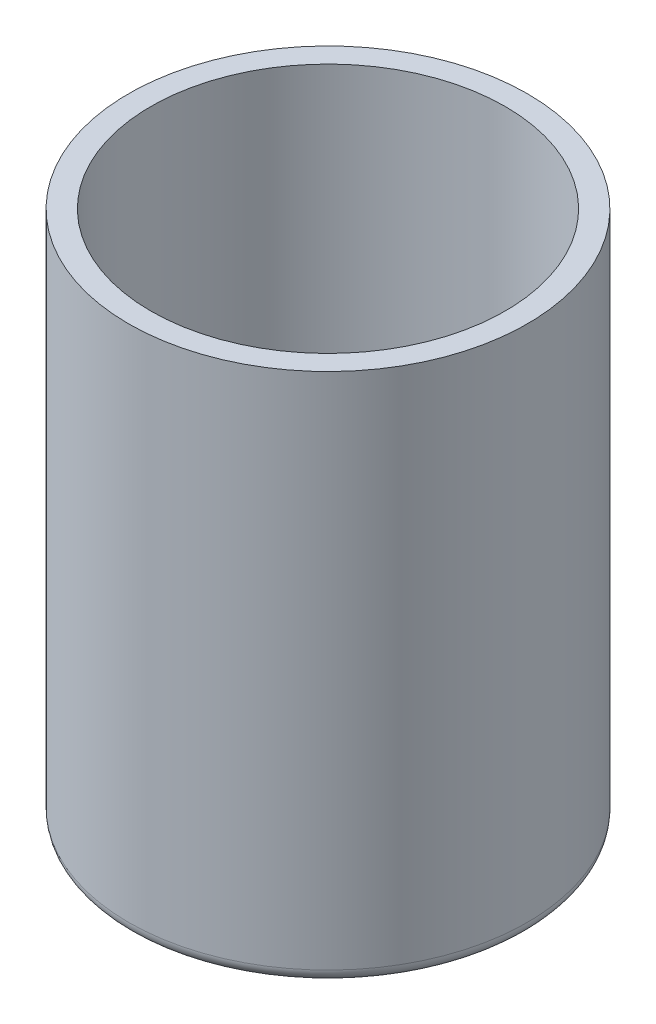
ISO-10303-21;
HEADER;
FILE_DESCRIPTION(('STEP AP214'),'2;1');
FILE_NAME('part.step','',(''),(''),'','','');
FILE_SCHEMA(('AUTOMOTIVE_DESIGN { 1 0 10303 214 1 1 1 1 }'));
ENDSEC;
DATA;
#1=APPLICATION_CONTEXT('core data for automotive mechanical design processes');
#2=APPLICATION_PROTOCOL_DEFINITION('international standard','automotive_design',2000,#1);
#3=PRODUCT_CONTEXT('',#1,'mechanical');
#4=PRODUCT('Part','Part','',(#3));
#5=PRODUCT_RELATED_PRODUCT_CATEGORY('part','',(#4));
#6=PRODUCT_DEFINITION_FORMATION('','',#4);
#7=PRODUCT_DEFINITION_CONTEXT('part definition',#1,'design');
#8=PRODUCT_DEFINITION('design','',#6,#7);
#9=PRODUCT_DEFINITION_SHAPE('','',#8);
#10=(LENGTH_UNIT() NAMED_UNIT(*) SI_UNIT(.MILLI.,.METRE.));
#11=(NAMED_UNIT(*) PLANE_ANGLE_UNIT() SI_UNIT($,.RADIAN.));
#12=(NAMED_UNIT(*) SI_UNIT($,.STERADIAN.) SOLID_ANGLE_UNIT());
#13=UNCERTAINTY_MEASURE_WITH_UNIT(LENGTH_MEASURE(1.E-05),#10,'distance_accuracy_value','');
#14=(GEOMETRIC_REPRESENTATION_CONTEXT(3) GLOBAL_UNCERTAINTY_ASSIGNED_CONTEXT((#13)) GLOBAL_UNIT_ASSIGNED_CONTEXT((#10,
#11,#12)) REPRESENTATION_CONTEXT('',''));
#15=CARTESIAN_POINT('',(0.,0.,0.));
#16=DIRECTION('',(0.,0.,1.));
#17=DIRECTION('',(1.,0.,0.));
#18=AXIS2_PLACEMENT_3D('',#15,#16,#17);
#19=CARTESIAN_POINT('',(0.,120.,0.));
#20=DIRECTION('',(0.,-1.,0.));
#21=DIRECTION('',(0.,0.,-1.));
#22=AXIS2_PLACEMENT_3D('',#19,#20,#21);
#23=CYLINDRICAL_SURFACE('',#22,45.);
#24=CARTESIAN_POINT('',(0.,3.,0.));
#25=DIRECTION('',(0.,1.,0.));
#26=DIRECTION('',(0.,0.,1.));
#27=AXIS2_PLACEMENT_3D('',#24,#25,#26);
#28=CIRCLE('',#27,45.);
#29=CARTESIAN_POINT('',(0.,3.,45.));
#30=VERTEX_POINT('',#29);
#31=EDGE_CURVE('E75',#30,#30,#28,.T.);
#32=ORIENTED_EDGE('',*,*,#31,.T.);
#33=EDGE_LOOP('',(#32));
#34=FACE_BOUND('',#33,.T.);
#35=CARTESIAN_POINT('',(0.,120.,0.));
#36=DIRECTION('',(0.,1.,0.));
#37=DIRECTION('',(0.,0.,1.));
#38=AXIS2_PLACEMENT_3D('',#35,#36,#37);
#39=CIRCLE('',#38,45.);
#40=CARTESIAN_POINT('',(0.,120.,45.));
#41=VERTEX_POINT('',#40);
#42=EDGE_CURVE('E78',#41,#41,#39,.T.);
#43=ORIENTED_EDGE('',*,*,#42,.F.);
#44=EDGE_LOOP('',(#43));
#45=FACE_BOUND('',#44,.T.);
#46=ADVANCED_FACE('F34',(#34,#45),#23,.T.);
#47=CARTESIAN_POINT('',(0.,120.,0.));
#48=DIRECTION('',(0.,1.,0.));
#49=DIRECTION('',(0.,0.,1.));
#50=AXIS2_PLACEMENT_3D('',#47,#48,#49);
#51=PLANE('',#50);
#52=CARTESIAN_POINT('',(0.,120.,0.));
#53=DIRECTION('',(0.,1.,0.));
#54=DIRECTION('',(0.,0.,1.));
#55=AXIS2_PLACEMENT_3D('',#52,#53,#54);
#56=CIRCLE('',#55,40.);
#57=CARTESIAN_POINT('',(0.,120.,40.));
#58=VERTEX_POINT('',#57);
#59=EDGE_CURVE('E82',#58,#58,#56,.T.);
#60=ORIENTED_EDGE('',*,*,#59,.F.);
#61=EDGE_LOOP('',(#60));
#62=FACE_BOUND('',#61,.T.);
#63=ORIENTED_EDGE('',*,*,#42,.T.);
#64=EDGE_LOOP('',(#63));
#65=FACE_BOUND('',#64,.T.);
#66=ADVANCED_FACE('F119',(#62,#65),#51,.T.);
#67=CARTESIAN_POINT('',(0.,0.,0.));
#68=DIRECTION('',(0.,1.,0.));
#69=DIRECTION('',(0.,0.,1.));
#70=AXIS2_PLACEMENT_3D('',#67,#68,#69);
#71=PLANE('',#70);
#72=CARTESIAN_POINT('',(0.,0.,0.));
#73=DIRECTION('',(0.,1.,0.));
#74=DIRECTION('',(0.,0.,1.));
#75=AXIS2_PLACEMENT_3D('',#72,#73,#74);
#76=CIRCLE('',#75,6.);
#77=CARTESIAN_POINT('',(0.,0.,6.));
#78=VERTEX_POINT('',#77);
#79=EDGE_CURVE('E10',#78,#78,#76,.T.);
#80=ORIENTED_EDGE('',*,*,#79,.T.);
#81=EDGE_LOOP('',(#80));
#82=FACE_BOUND('',#81,.T.);
#83=CARTESIAN_POINT('',(0.,0.,15.));
#84=DIRECTION('',(0.,1.,0.));
#85=DIRECTION('',(0.,0.,1.));
#86=AXIS2_PLACEMENT_3D('',#83,#84,#85);
#87=CIRCLE('',#86,4.);
#88=CARTESIAN_POINT('',(0.,0.,19.));
#89=VERTEX_POINT('',#88);
#90=EDGE_CURVE('E45',#89,#89,#87,.T.);
#91=ORIENTED_EDGE('',*,*,#90,.T.);
#92=EDGE_LOOP('',(#91));
#93=FACE_BOUND('',#92,.T.);
#94=CARTESIAN_POINT('',(1.57116660247941E-13,0.,-15.));
#95=DIRECTION('',(0.,1.,0.));
#96=DIRECTION('',(0.,0.,1.));
#97=AXIS2_PLACEMENT_3D('',#94,#95,#96);
#98=CIRCLE('',#97,4.);
#99=CARTESIAN_POINT('',(1.57116660247941E-13,0.,-11.));
#100=VERTEX_POINT('',#99);
#101=EDGE_CURVE('E54',#100,#100,#98,.T.);
#102=ORIENTED_EDGE('',*,*,#101,.T.);
#103=EDGE_LOOP('',(#102));
#104=FACE_BOUND('',#103,.T.);
#105=CARTESIAN_POINT('',(30.,0.,0.));
#106=DIRECTION('',(0.,1.,0.));
#107=DIRECTION('',(0.,0.,1.));
#108=AXIS2_PLACEMENT_3D('',#105,#106,#107);
#109=CIRCLE('',#108,7.2);
#110=CARTESIAN_POINT('',(30.,0.,7.2));
#111=VERTEX_POINT('',#110);
#112=EDGE_CURVE('E63',#111,#111,#109,.T.);
#113=ORIENTED_EDGE('',*,*,#112,.T.);
#114=EDGE_LOOP('',(#113));
#115=FACE_BOUND('',#114,.T.);
#116=CARTESIAN_POINT('',(-30.,0.,2.09488880330588E-13));
#117=DIRECTION('',(0.,1.,0.));
#118=DIRECTION('',(0.,0.,1.));
#119=AXIS2_PLACEMENT_3D('',#116,#117,#118);
#120=CIRCLE('',#119,7.2);
#121=CARTESIAN_POINT('',(-30.,0.,7.20000000000021));
#122=VERTEX_POINT('',#121);
#123=EDGE_CURVE('E69',#122,#122,#120,.T.);
#124=ORIENTED_EDGE('',*,*,#123,.T.);
#125=EDGE_LOOP('',(#124));
#126=FACE_BOUND('',#125,.T.);
#127=CARTESIAN_POINT('',(0.,0.,0.));
#128=DIRECTION('',(0.,1.,0.));
#129=DIRECTION('',(0.,0.,1.));
#130=AXIS2_PLACEMENT_3D('',#127,#128,#129);
#131=CIRCLE('',#130,42.);
#132=CARTESIAN_POINT('',(0.,0.,42.));
#133=VERTEX_POINT('',#132);
#134=EDGE_CURVE('E72',#133,#133,#131,.F.);
#135=ORIENTED_EDGE('',*,*,#134,.T.);
#136=EDGE_LOOP('',(#135));
#137=FACE_BOUND('',#136,.T.);
#138=ADVANCED_FACE('F125',(#82,#93,#104,#115,#126,#137),#71,.F.);
#139=CARTESIAN_POINT('',(0.,4.99999999999999,0.));
#140=DIRECTION('',(0.,1.,0.));
#141=DIRECTION('',(0.,0.,1.));
#142=AXIS2_PLACEMENT_3D('',#139,#140,#141);
#143=CYLINDRICAL_SURFACE('',#142,40.);
#144=CARTESIAN_POINT('',(0.,4.99999999999999,0.));
#145=DIRECTION('',(0.,1.,0.));
#146=DIRECTION('',(0.,0.,1.));
#147=AXIS2_PLACEMENT_3D('',#144,#145,#146);
#148=CIRCLE('',#147,40.);
#149=CARTESIAN_POINT('',(0.,4.99999999999999,40.));
#150=VERTEX_POINT('',#149);
#151=EDGE_CURVE('E81',#150,#150,#148,.T.);
#152=ORIENTED_EDGE('',*,*,#151,.F.);
#153=EDGE_LOOP('',(#152));
#154=FACE_BOUND('',#153,.T.);
#155=ORIENTED_EDGE('',*,*,#59,.T.);
#156=EDGE_LOOP('',(#155));
#157=FACE_BOUND('',#156,.T.);
#158=ADVANCED_FACE('F162',(#154,#157),#143,.F.);
#159=CARTESIAN_POINT('',(0.,4.99999999999999,0.));
#160=DIRECTION('',(0.,1.,0.));
#161=DIRECTION('',(0.,0.,1.));
#162=AXIS2_PLACEMENT_3D('',#159,#160,#161);
#163=PLANE('',#162);
#164=CARTESIAN_POINT('',(0.,4.99999999999999,0.));
#165=DIRECTION('',(0.,1.,0.));
#166=DIRECTION('',(0.,0.,1.));
#167=AXIS2_PLACEMENT_3D('',#164,#165,#166);
#168=CIRCLE('',#167,5.);
#169=CARTESIAN_POINT('',(0.,4.99999999999999,5.));
#170=VERTEX_POINT('',#169);
#171=EDGE_CURVE('E97',#170,#170,#168,.F.);
#172=ORIENTED_EDGE('',*,*,#171,.T.);
#173=EDGE_LOOP('',(#172));
#174=FACE_BOUND('',#173,.T.);
#175=CARTESIAN_POINT('',(0.,4.99999999999999,15.));
#176=DIRECTION('',(0.,1.,0.));
#177=DIRECTION('',(0.,0.,1.));
#178=AXIS2_PLACEMENT_3D('',#175,#176,#177);
#179=CIRCLE('',#178,3.);
#180=CARTESIAN_POINT('',(0.,4.99999999999999,18.));
#181=VERTEX_POINT('',#180);
#182=EDGE_CURVE('E91',#181,#181,#179,.F.);
#183=ORIENTED_EDGE('',*,*,#182,.T.);
#184=EDGE_LOOP('',(#183));
#185=FACE_BOUND('',#184,.T.);
#186=CARTESIAN_POINT('',(1.57116660247941E-13,4.99999999999999,-15.));
#187=DIRECTION('',(0.,1.,0.));
#188=DIRECTION('',(0.,0.,1.));
#189=AXIS2_PLACEMENT_3D('',#186,#187,#188);
#190=CIRCLE('',#189,3.);
#191=CARTESIAN_POINT('',(1.57116660247941E-13,4.99999999999999,-12.));
#192=VERTEX_POINT('',#191);
#193=EDGE_CURVE('E94',#192,#192,#190,.F.);
#194=ORIENTED_EDGE('',*,*,#193,.T.);
#195=EDGE_LOOP('',(#194));
#196=FACE_BOUND('',#195,.T.);
#197=CARTESIAN_POINT('',(30.,4.99999999999999,0.));
#198=DIRECTION('',(0.,1.,0.));
#199=DIRECTION('',(0.,0.,1.));
#200=AXIS2_PLACEMENT_3D('',#197,#198,#199);
#201=CIRCLE('',#200,6.2);
#202=CARTESIAN_POINT('',(30.,4.99999999999999,6.2));
#203=VERTEX_POINT('',#202);
#204=EDGE_CURVE('E85',#203,#203,#201,.T.);
#205=ORIENTED_EDGE('',*,*,#204,.F.);
#206=EDGE_LOOP('',(#205));
#207=FACE_BOUND('',#206,.T.);
#208=CARTESIAN_POINT('',(-30.,4.99999999999999,2.09488880330588E-13));
#209=DIRECTION('',(0.,1.,0.));
#210=DIRECTION('',(0.,0.,1.));
#211=AXIS2_PLACEMENT_3D('',#208,#209,#210);
#212=CIRCLE('',#211,6.2);
#213=CARTESIAN_POINT('',(-30.,4.99999999999999,6.20000000000021));
#214=VERTEX_POINT('',#213);
#215=EDGE_CURVE('E88',#214,#214,#212,.T.);
#216=ORIENTED_EDGE('',*,*,#215,.F.);
#217=EDGE_LOOP('',(#216));
#218=FACE_BOUND('',#217,.T.);
#219=ORIENTED_EDGE('',*,*,#151,.T.);
#220=EDGE_LOOP('',(#219));
#221=FACE_BOUND('',#220,.T.);
#222=ADVANCED_FACE('F103',(#174,#185,#196,#207,#218,#221),#163,.T.);
#223=CARTESIAN_POINT('',(-30.,22.5362481734264,2.09488880330588E-13));
#224=DIRECTION('',(0.,-1.,0.));
#225=DIRECTION('',(0.,0.,-1.));
#226=AXIS2_PLACEMENT_3D('',#223,#224,#225);
#227=CYLINDRICAL_SURFACE('',#226,6.2);
#228=CARTESIAN_POINT('',(-30.,1.,2.09488880330588E-13));
#229=DIRECTION('',(0.,1.,0.));
#230=DIRECTION('',(0.,0.,1.));
#231=AXIS2_PLACEMENT_3D('',#228,#229,#230);
#232=CIRCLE('',#231,6.2);
#233=CARTESIAN_POINT('',(-30.,1.,6.20000000000021));
#234=VERTEX_POINT('',#233);
#235=EDGE_CURVE('E66',#234,#234,#232,.F.);
#236=ORIENTED_EDGE('',*,*,#235,.T.);
#237=EDGE_LOOP('',(#236));
#238=FACE_BOUND('',#237,.T.);
#239=ORIENTED_EDGE('',*,*,#215,.T.);
#240=EDGE_LOOP('',(#239));
#241=FACE_BOUND('',#240,.T.);
#242=ADVANCED_FACE('F161',(#238,#241),#227,.F.);
#243=CARTESIAN_POINT('',(30.,22.5362481734264,0.));
#244=DIRECTION('',(0.,-1.,0.));
#245=DIRECTION('',(0.,0.,-1.));
#246=AXIS2_PLACEMENT_3D('',#243,#244,#245);
#247=CYLINDRICAL_SURFACE('',#246,6.2);
#248=CARTESIAN_POINT('',(30.,1.,0.));
#249=DIRECTION('',(0.,1.,0.));
#250=DIRECTION('',(0.,0.,1.));
#251=AXIS2_PLACEMENT_3D('',#248,#249,#250);
#252=CIRCLE('',#251,6.2);
#253=CARTESIAN_POINT('',(30.,1.,6.2));
#254=VERTEX_POINT('',#253);
#255=EDGE_CURVE('E60',#254,#254,#252,.F.);
#256=ORIENTED_EDGE('',*,*,#255,.T.);
#257=EDGE_LOOP('',(#256));
#258=FACE_BOUND('',#257,.T.);
#259=ORIENTED_EDGE('',*,*,#204,.T.);
#260=EDGE_LOOP('',(#259));
#261=FACE_BOUND('',#260,.T.);
#262=ADVANCED_FACE('F155',(#258,#261),#247,.F.);
#263=CARTESIAN_POINT('',(1.57116660247941E-13,13.4852813742386,-15.));
#264=DIRECTION('',(0.,-1.,0.));
#265=DIRECTION('',(0.,0.,-1.));
#266=AXIS2_PLACEMENT_3D('',#263,#264,#265);
#267=CYLINDRICAL_SURFACE('',#266,3.);
#268=CARTESIAN_POINT('',(1.57116660247941E-13,1.,-15.));
#269=DIRECTION('',(0.,1.,0.));
#270=DIRECTION('',(0.,0.,1.));
#271=AXIS2_PLACEMENT_3D('',#268,#269,#270);
#272=CIRCLE('',#271,3.);
#273=CARTESIAN_POINT('',(1.57116660247941E-13,1.,-12.));
#274=VERTEX_POINT('',#273);
#275=EDGE_CURVE('E57',#274,#274,#272,.F.);
#276=ORIENTED_EDGE('',*,*,#275,.T.);
#277=EDGE_LOOP('',(#276));
#278=FACE_BOUND('',#277,.T.);
#279=ORIENTED_EDGE('',*,*,#193,.F.);
#280=EDGE_LOOP('',(#279));
#281=FACE_BOUND('',#280,.T.);
#282=ADVANCED_FACE('F152',(#278,#281),#267,.F.);
#283=CARTESIAN_POINT('',(0.,13.4852813742386,15.));
#284=DIRECTION('',(0.,-1.,0.));
#285=DIRECTION('',(0.,0.,-1.));
#286=AXIS2_PLACEMENT_3D('',#283,#284,#285);
#287=CYLINDRICAL_SURFACE('',#286,3.);
#288=CARTESIAN_POINT('',(0.,1.,15.));
#289=DIRECTION('',(0.,1.,0.));
#290=DIRECTION('',(0.,0.,1.));
#291=AXIS2_PLACEMENT_3D('',#288,#289,#290);
#292=CIRCLE('',#291,3.);
#293=CARTESIAN_POINT('',(0.,1.,18.));
#294=VERTEX_POINT('',#293);
#295=EDGE_CURVE('E49',#294,#294,#292,.F.);
#296=ORIENTED_EDGE('',*,*,#295,.T.);
#297=EDGE_LOOP('',(#296));
#298=FACE_BOUND('',#297,.T.);
#299=ORIENTED_EDGE('',*,*,#182,.F.);
#300=EDGE_LOOP('',(#299));
#301=FACE_BOUND('',#300,.T.);
#302=ADVANCED_FACE('F135',(#298,#301),#287,.F.);
#303=CARTESIAN_POINT('',(0.,3.,0.));
#304=DIRECTION('',(0.,1.,0.));
#305=DIRECTION('',(0.,0.,1.));
#306=AXIS2_PLACEMENT_3D('',#303,#304,#305);
#307=TOROIDAL_SURFACE('',#306,42.,3.);
#308=ORIENTED_EDGE('',*,*,#134,.F.);
#309=EDGE_LOOP('',(#308));
#310=FACE_BOUND('',#309,.T.);
#311=ORIENTED_EDGE('',*,*,#31,.F.);
#312=EDGE_LOOP('',(#311));
#313=FACE_BOUND('',#312,.T.);
#314=ADVANCED_FACE('F131',(#310,#313),#307,.T.);
#315=CARTESIAN_POINT('',(-30.,1.,2.09488880330588E-13));
#316=DIRECTION('',(0.,1.,0.));
#317=DIRECTION('',(0.,0.,1.));
#318=AXIS2_PLACEMENT_3D('',#315,#316,#317);
#319=TOROIDAL_SURFACE('',#318,7.2,1.);
#320=ORIENTED_EDGE('',*,*,#235,.F.);
#321=EDGE_LOOP('',(#320));
#322=FACE_BOUND('',#321,.T.);
#323=ORIENTED_EDGE('',*,*,#123,.F.);
#324=EDGE_LOOP('',(#323));
#325=FACE_BOUND('',#324,.T.);
#326=ADVANCED_FACE('F134',(#322,#325),#319,.T.);
#327=CARTESIAN_POINT('',(30.,1.,0.));
#328=DIRECTION('',(0.,1.,0.));
#329=DIRECTION('',(0.,0.,1.));
#330=AXIS2_PLACEMENT_3D('',#327,#328,#329);
#331=TOROIDAL_SURFACE('',#330,7.2,1.);
#332=ORIENTED_EDGE('',*,*,#255,.F.);
#333=EDGE_LOOP('',(#332));
#334=FACE_BOUND('',#333,.T.);
#335=ORIENTED_EDGE('',*,*,#112,.F.);
#336=EDGE_LOOP('',(#335));
#337=FACE_BOUND('',#336,.T.);
#338=ADVANCED_FACE('F139',(#334,#337),#331,.T.);
#339=CARTESIAN_POINT('',(1.57116660247941E-13,1.,-15.));
#340=DIRECTION('',(0.,1.,0.));
#341=DIRECTION('',(0.,0.,1.));
#342=AXIS2_PLACEMENT_3D('',#339,#340,#341);
#343=TOROIDAL_SURFACE('',#342,4.,1.);
#344=ORIENTED_EDGE('',*,*,#101,.F.);
#345=EDGE_LOOP('',(#344));
#346=FACE_BOUND('',#345,.T.);
#347=ORIENTED_EDGE('',*,*,#275,.F.);
#348=EDGE_LOOP('',(#347));
#349=FACE_BOUND('',#348,.T.);
#350=ADVANCED_FACE('F115',(#346,#349),#343,.T.);
#351=CARTESIAN_POINT('',(0.,1.,15.));
#352=DIRECTION('',(0.,1.,0.));
#353=DIRECTION('',(0.,0.,1.));
#354=AXIS2_PLACEMENT_3D('',#351,#352,#353);
#355=TOROIDAL_SURFACE('',#354,4.,1.);
#356=ORIENTED_EDGE('',*,*,#90,.F.);
#357=EDGE_LOOP('',(#356));
#358=FACE_BOUND('',#357,.T.);
#359=ORIENTED_EDGE('',*,*,#295,.F.);
#360=EDGE_LOOP('',(#359));
#361=FACE_BOUND('',#360,.T.);
#362=ADVANCED_FACE('F108',(#358,#361),#355,.T.);
#363=CARTESIAN_POINT('',(0.,19.1421356237309,0.));
#364=DIRECTION('',(0.,-1.,0.));
#365=DIRECTION('',(0.,0.,-1.));
#366=AXIS2_PLACEMENT_3D('',#363,#364,#365);
#367=CYLINDRICAL_SURFACE('',#366,5.);
#368=CARTESIAN_POINT('',(0.,1.,0.));
#369=DIRECTION('',(0.,1.,0.));
#370=DIRECTION('',(0.,0.,1.));
#371=AXIS2_PLACEMENT_3D('',#368,#369,#370);
#372=CIRCLE('',#371,5.);
#373=CARTESIAN_POINT('',(0.,1.,5.));
#374=VERTEX_POINT('',#373);
#375=EDGE_CURVE('E41',#374,#374,#372,.F.);
#376=ORIENTED_EDGE('',*,*,#375,.T.);
#377=EDGE_LOOP('',(#376));
#378=FACE_BOUND('',#377,.T.);
#379=ORIENTED_EDGE('',*,*,#171,.F.);
#380=EDGE_LOOP('',(#379));
#381=FACE_BOUND('',#380,.T.);
#382=ADVANCED_FACE('F106',(#378,#381),#367,.F.);
#383=CARTESIAN_POINT('',(0.,1.,0.));
#384=DIRECTION('',(0.,1.,0.));
#385=DIRECTION('',(0.,0.,1.));
#386=AXIS2_PLACEMENT_3D('',#383,#384,#385);
#387=TOROIDAL_SURFACE('',#386,6.,1.);
#388=ORIENTED_EDGE('',*,*,#79,.F.);
#389=EDGE_LOOP('',(#388));
#390=FACE_BOUND('',#389,.T.);
#391=ORIENTED_EDGE('',*,*,#375,.F.);
#392=EDGE_LOOP('',(#391));
#393=FACE_BOUND('',#392,.T.);
#394=ADVANCED_FACE('F36',(#390,#393),#387,.T.);
#395=CLOSED_SHELL('',(#46,#66,#138,#158,#222,#242,#262,#282,#302,#314,#326,#338,#350,#362,#382,#394));
#396=MANIFOLD_SOLID_BREP('B2',#395);
#397=ADVANCED_BREP_SHAPE_REPRESENTATION('',(#18,#396),#14);
#398=SHAPE_DEFINITION_REPRESENTATION(#9,#397);
ENDSEC;
END-ISO-10303-21;
